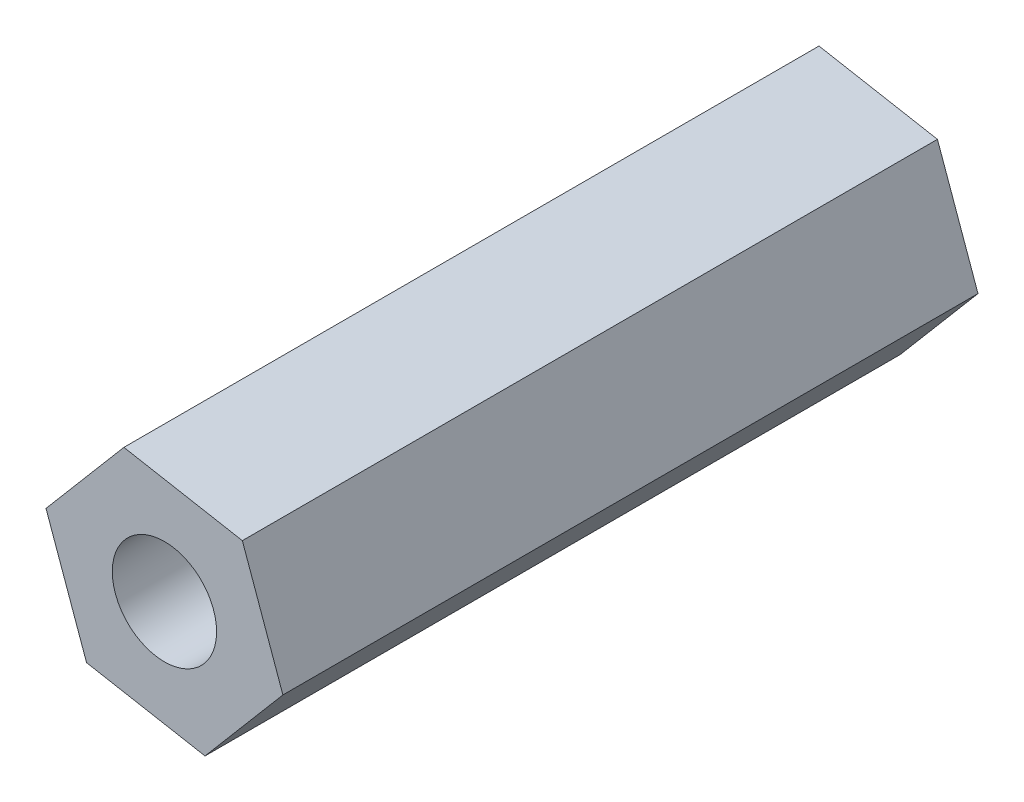
ISO-10303-21;
HEADER;
FILE_DESCRIPTION(('STEP AP214'),'2;1');
FILE_NAME('part.step','',(''),(''),'','','');
FILE_SCHEMA(('AUTOMOTIVE_DESIGN { 1 0 10303 214 1 1 1 1 }'));
ENDSEC;
DATA;
#1=APPLICATION_CONTEXT('core data for automotive mechanical design processes');
#2=APPLICATION_PROTOCOL_DEFINITION('international standard','automotive_design',2000,#1);
#3=PRODUCT_CONTEXT('',#1,'mechanical');
#4=PRODUCT('Part','Part','',(#3));
#5=PRODUCT_RELATED_PRODUCT_CATEGORY('part','',(#4));
#6=PRODUCT_DEFINITION_FORMATION('','',#4);
#7=PRODUCT_DEFINITION_CONTEXT('part definition',#1,'design');
#8=PRODUCT_DEFINITION('design','',#6,#7);
#9=PRODUCT_DEFINITION_SHAPE('','',#8);
#10=(LENGTH_UNIT() NAMED_UNIT(*) SI_UNIT(.MILLI.,.METRE.));
#11=(NAMED_UNIT(*) PLANE_ANGLE_UNIT() SI_UNIT($,.RADIAN.));
#12=(NAMED_UNIT(*) SI_UNIT($,.STERADIAN.) SOLID_ANGLE_UNIT());
#13=UNCERTAINTY_MEASURE_WITH_UNIT(LENGTH_MEASURE(1.E-05),#10,'distance_accuracy_value','');
#14=(GEOMETRIC_REPRESENTATION_CONTEXT(3) GLOBAL_UNCERTAINTY_ASSIGNED_CONTEXT((#13)) GLOBAL_UNIT_ASSIGNED_CONTEXT((#10,
#11,#12)) REPRESENTATION_CONTEXT('',''));
#15=CARTESIAN_POINT('',(0.,0.,0.));
#16=DIRECTION('',(0.,0.,1.));
#17=DIRECTION('',(1.,0.,0.));
#18=AXIS2_PLACEMENT_3D('',#15,#16,#17);
#19=CARTESIAN_POINT('',(14.100105118259,-7.40552271774973,20.));
#20=DIRECTION('',(-0.941553473498977,-0.336863557753005,0.));
#21=DIRECTION('',(0.336863557753005,-0.941553473498977,0.));
#22=AXIS2_PLACEMENT_3D('',#19,#20,#21);
#23=PLANE('',#22);
#24=DIRECTION('',(-0.336863557753005,0.941553473498977,0.));
#25=VECTOR('',#24,1.);
#26=CARTESIAN_POINT('',(14.100105118259,-7.40552271774973,0.));
#27=LINE('',#26,#25);
#28=CARTESIAN_POINT('',(14.100105118259,-7.40552271774973,0.));
#29=VERTEX_POINT('',#28);
#30=CARTESIAN_POINT('',(12.9331755237658,-4.14388580946336,0.));
#31=VERTEX_POINT('',#30);
#32=EDGE_CURVE('E117',#29,#31,#27,.T.);
#33=ORIENTED_EDGE('',*,*,#32,.T.);
#34=DIRECTION('',(0.,0.,-1.));
#35=VECTOR('',#34,1.);
#36=CARTESIAN_POINT('',(12.9331755237658,-4.14388580946336,20.));
#37=LINE('',#36,#35);
#38=CARTESIAN_POINT('',(12.9331755237658,-4.14388580946336,20.));
#39=VERTEX_POINT('',#38);
#40=EDGE_CURVE('E11',#39,#31,#37,.T.);
#41=ORIENTED_EDGE('',*,*,#40,.F.);
#42=DIRECTION('',(-0.336863557753005,0.941553473498977,0.));
#43=VECTOR('',#42,1.);
#44=CARTESIAN_POINT('',(14.100105118259,-7.40552271774973,20.));
#45=LINE('',#44,#43);
#46=CARTESIAN_POINT('',(14.100105118259,-7.40552271774973,20.));
#47=VERTEX_POINT('',#46);
#48=EDGE_CURVE('E128',#47,#39,#45,.T.);
#49=ORIENTED_EDGE('',*,*,#48,.F.);
#50=DIRECTION('',(0.,0.,-1.));
#51=VECTOR('',#50,1.);
#52=CARTESIAN_POINT('',(14.100105118259,-7.40552271774973,20.));
#53=LINE('',#52,#51);
#54=EDGE_CURVE('E113',#47,#29,#53,.T.);
#55=ORIENTED_EDGE('',*,*,#54,.T.);
#56=EDGE_LOOP('',(#33,#41,#49,#55));
#57=FACE_BOUND('',#56,.T.);
#58=ADVANCED_FACE('F33',(#57),#23,.F.);
#59=CARTESIAN_POINT('',(12.9331755237658,-4.14388580946336,20.));
#60=DIRECTION('',(-0.17904433812618,-0.983841005948094,0.));
#61=DIRECTION('',(0.983841005948094,-0.17904433812618,0.));
#62=AXIS2_PLACEMENT_3D('',#59,#60,#61);
#63=PLANE('',#62);
#64=DIRECTION('',(-0.983841005948094,0.17904433812618,0.));
#65=VECTOR('',#64,1.);
#66=CARTESIAN_POINT('',(12.9331755237658,-4.14388580946336,0.));
#67=LINE('',#66,#65);
#68=CARTESIAN_POINT('',(9.52505030602222,-3.52365802857919,0.));
#69=VERTEX_POINT('',#68);
#70=EDGE_CURVE('E120',#31,#69,#67,.T.);
#71=ORIENTED_EDGE('',*,*,#70,.T.);
#72=DIRECTION('',(0.,0.,-1.));
#73=VECTOR('',#72,1.);
#74=CARTESIAN_POINT('',(9.52505030602222,-3.52365802857919,20.));
#75=LINE('',#74,#73);
#76=CARTESIAN_POINT('',(9.52505030602222,-3.52365802857919,20.));
#77=VERTEX_POINT('',#76);
#78=EDGE_CURVE('E41',#77,#69,#75,.T.);
#79=ORIENTED_EDGE('',*,*,#78,.F.);
#80=DIRECTION('',(-0.983841005948094,0.17904433812618,0.));
#81=VECTOR('',#80,1.);
#82=CARTESIAN_POINT('',(12.9331755237658,-4.14388580946336,20.));
#83=LINE('',#82,#81);
#84=EDGE_CURVE('E86',#39,#77,#83,.T.);
#85=ORIENTED_EDGE('',*,*,#84,.F.);
#86=ORIENTED_EDGE('',*,*,#40,.T.);
#87=EDGE_LOOP('',(#71,#79,#85,#86));
#88=FACE_BOUND('',#87,.T.);
#89=ADVANCED_FACE('F153',(#88),#63,.F.);
#90=CARTESIAN_POINT('',(9.52505030602222,-3.52365802857919,20.));
#91=DIRECTION('',(0.762509135372797,-0.64697744819509,0.));
#92=DIRECTION('',(0.64697744819509,0.762509135372797,0.));
#93=AXIS2_PLACEMENT_3D('',#90,#91,#92);
#94=PLANE('',#93);
#95=DIRECTION('',(-0.64697744819509,-0.762509135372797,0.));
#96=VECTOR('',#95,1.);
#97=CARTESIAN_POINT('',(9.52505030602222,-3.52365802857919,0.));
#98=LINE('',#97,#96);
#99=CARTESIAN_POINT('',(7.28385468277191,-6.16506715598138,0.));
#100=VERTEX_POINT('',#99);
#101=EDGE_CURVE('E123',#69,#100,#98,.T.);
#102=ORIENTED_EDGE('',*,*,#101,.T.);
#103=DIRECTION('',(0.,0.,-1.));
#104=VECTOR('',#103,1.);
#105=CARTESIAN_POINT('',(7.28385468277191,-6.16506715598138,20.));
#106=LINE('',#105,#104);
#107=CARTESIAN_POINT('',(7.28385468277191,-6.16506715598138,20.));
#108=VERTEX_POINT('',#107);
#109=EDGE_CURVE('E108',#108,#100,#106,.T.);
#110=ORIENTED_EDGE('',*,*,#109,.F.);
#111=DIRECTION('',(-0.64697744819509,-0.762509135372797,0.));
#112=VECTOR('',#111,1.);
#113=CARTESIAN_POINT('',(9.52505030602222,-3.52365802857919,20.));
#114=LINE('',#113,#112);
#115=EDGE_CURVE('E99',#77,#108,#114,.T.);
#116=ORIENTED_EDGE('',*,*,#115,.F.);
#117=ORIENTED_EDGE('',*,*,#78,.T.);
#118=EDGE_LOOP('',(#102,#110,#116,#117));
#119=FACE_BOUND('',#118,.T.);
#120=ADVANCED_FACE('F134',(#119),#94,.F.);
#121=CARTESIAN_POINT('',(7.28385468277191,-6.16506715598138,20.));
#122=DIRECTION('',(0.941553473498977,0.336863557753005,0.));
#123=DIRECTION('',(-0.336863557753005,0.941553473498977,0.));
#124=AXIS2_PLACEMENT_3D('',#121,#122,#123);
#125=PLANE('',#124);
#126=DIRECTION('',(0.336863557753005,-0.941553473498977,0.));
#127=VECTOR('',#126,1.);
#128=CARTESIAN_POINT('',(7.28385468277191,-6.16506715598138,0.));
#129=LINE('',#128,#127);
#130=CARTESIAN_POINT('',(8.45078427726515,-9.42670406426776,0.));
#131=VERTEX_POINT('',#130);
#132=EDGE_CURVE('E107',#100,#131,#129,.T.);
#133=ORIENTED_EDGE('',*,*,#132,.T.);
#134=DIRECTION('',(0.,0.,-1.));
#135=VECTOR('',#134,1.);
#136=CARTESIAN_POINT('',(8.45078427726515,-9.42670406426776,20.));
#137=LINE('',#136,#135);
#138=CARTESIAN_POINT('',(8.45078427726515,-9.42670406426776,20.));
#139=VERTEX_POINT('',#138);
#140=EDGE_CURVE('E104',#139,#131,#137,.T.);
#141=ORIENTED_EDGE('',*,*,#140,.F.);
#142=DIRECTION('',(0.336863557753005,-0.941553473498977,0.));
#143=VECTOR('',#142,1.);
#144=CARTESIAN_POINT('',(7.28385468277191,-6.16506715598138,20.));
#145=LINE('',#144,#143);
#146=EDGE_CURVE('E93',#108,#139,#145,.T.);
#147=ORIENTED_EDGE('',*,*,#146,.F.);
#148=ORIENTED_EDGE('',*,*,#109,.T.);
#149=EDGE_LOOP('',(#133,#141,#147,#148));
#150=FACE_BOUND('',#149,.T.);
#151=ADVANCED_FACE('F105',(#150),#125,.F.);
#152=CARTESIAN_POINT('',(8.45078427726515,-9.42670406426776,20.));
#153=DIRECTION('',(0.17904433812618,0.983841005948094,0.));
#154=DIRECTION('',(-0.983841005948094,0.17904433812618,0.));
#155=AXIS2_PLACEMENT_3D('',#152,#153,#154);
#156=PLANE('',#155);
#157=DIRECTION('',(0.983841005948094,-0.17904433812618,0.));
#158=VECTOR('',#157,1.);
#159=CARTESIAN_POINT('',(8.45078427726515,-9.42670406426776,0.));
#160=LINE('',#159,#158);
#161=CARTESIAN_POINT('',(11.8589094950087,-10.0469318451519,0.));
#162=VERTEX_POINT('',#161);
#163=EDGE_CURVE('E72',#131,#162,#160,.T.);
#164=ORIENTED_EDGE('',*,*,#163,.T.);
#165=DIRECTION('',(0.,0.,-1.));
#166=VECTOR('',#165,1.);
#167=CARTESIAN_POINT('',(11.8589094950087,-10.0469318451519,20.));
#168=LINE('',#167,#166);
#169=CARTESIAN_POINT('',(11.8589094950087,-10.0469318451519,20.));
#170=VERTEX_POINT('',#169);
#171=EDGE_CURVE('E109',#170,#162,#168,.T.);
#172=ORIENTED_EDGE('',*,*,#171,.F.);
#173=DIRECTION('',(0.983841005948094,-0.17904433812618,0.));
#174=VECTOR('',#173,1.);
#175=CARTESIAN_POINT('',(8.45078427726515,-9.42670406426776,20.));
#176=LINE('',#175,#174);
#177=EDGE_CURVE('E97',#139,#170,#176,.T.);
#178=ORIENTED_EDGE('',*,*,#177,.F.);
#179=ORIENTED_EDGE('',*,*,#140,.T.);
#180=EDGE_LOOP('',(#164,#172,#178,#179));
#181=FACE_BOUND('',#180,.T.);
#182=ADVANCED_FACE('F111',(#181),#156,.F.);
#183=CARTESIAN_POINT('',(11.8589094950087,-10.0469318451519,20.));
#184=DIRECTION('',(-0.762509135372797,0.64697744819509,0.));
#185=DIRECTION('',(-0.64697744819509,-0.762509135372797,0.));
#186=AXIS2_PLACEMENT_3D('',#183,#184,#185);
#187=PLANE('',#186);
#188=DIRECTION('',(0.64697744819509,0.762509135372797,0.));
#189=VECTOR('',#188,1.);
#190=CARTESIAN_POINT('',(11.8589094950087,-10.0469318451519,0.));
#191=LINE('',#190,#189);
#192=EDGE_CURVE('E78',#162,#29,#191,.T.);
#193=ORIENTED_EDGE('',*,*,#192,.T.);
#194=ORIENTED_EDGE('',*,*,#54,.F.);
#195=DIRECTION('',(0.64697744819509,0.762509135372797,0.));
#196=VECTOR('',#195,1.);
#197=CARTESIAN_POINT('',(11.8589094950087,-10.0469318451519,20.));
#198=LINE('',#197,#196);
#199=EDGE_CURVE('E49',#170,#47,#198,.T.);
#200=ORIENTED_EDGE('',*,*,#199,.F.);
#201=ORIENTED_EDGE('',*,*,#171,.T.);
#202=EDGE_LOOP('',(#193,#194,#200,#201));
#203=FACE_BOUND('',#202,.T.);
#204=ADVANCED_FACE('F141',(#203),#187,.F.);
#205=CARTESIAN_POINT('',(0.,0.,20.));
#206=DIRECTION('',(0.,0.,1.));
#207=DIRECTION('',(1.,0.,0.));
#208=AXIS2_PLACEMENT_3D('',#205,#206,#207);
#209=PLANE('',#208);
#210=CARTESIAN_POINT('',(10.6919799005155,-6.78529493686556,20.));
#211=DIRECTION('',(0.,0.,1.));
#212=DIRECTION('',(1.,0.,0.));
#213=AXIS2_PLACEMENT_3D('',#210,#211,#212);
#214=CIRCLE('',#213,1.5);
#215=CARTESIAN_POINT('',(12.1919799005155,-6.78529493686556,20.));
#216=VERTEX_POINT('',#215);
#217=EDGE_CURVE('E121',#216,#216,#214,.T.);
#218=ORIENTED_EDGE('',*,*,#217,.F.);
#219=EDGE_LOOP('',(#218));
#220=FACE_BOUND('',#219,.T.);
#221=ORIENTED_EDGE('',*,*,#48,.T.);
#222=ORIENTED_EDGE('',*,*,#84,.T.);
#223=ORIENTED_EDGE('',*,*,#115,.T.);
#224=ORIENTED_EDGE('',*,*,#146,.T.);
#225=ORIENTED_EDGE('',*,*,#177,.T.);
#226=ORIENTED_EDGE('',*,*,#199,.T.);
#227=EDGE_LOOP('',(#221,#222,#223,#224,#225,#226));
#228=FACE_BOUND('',#227,.T.);
#229=ADVANCED_FACE('F95',(#220,#228),#209,.T.);
#230=CARTESIAN_POINT('',(0.,0.,0.));
#231=DIRECTION('',(0.,0.,1.));
#232=DIRECTION('',(1.,0.,0.));
#233=AXIS2_PLACEMENT_3D('',#230,#231,#232);
#234=PLANE('',#233);
#235=CARTESIAN_POINT('',(10.6919799005155,-6.78529493686556,0.));
#236=DIRECTION('',(0.,0.,-1.));
#237=DIRECTION('',(-1.,0.,0.));
#238=AXIS2_PLACEMENT_3D('',#235,#236,#237);
#239=CIRCLE('',#238,1.5);
#240=CARTESIAN_POINT('',(9.19197990051546,-6.78529493686556,0.));
#241=VERTEX_POINT('',#240);
#242=EDGE_CURVE('E208',#241,#241,#239,.T.);
#243=ORIENTED_EDGE('',*,*,#242,.F.);
#244=EDGE_LOOP('',(#243));
#245=FACE_BOUND('',#244,.T.);
#246=ORIENTED_EDGE('',*,*,#32,.F.);
#247=ORIENTED_EDGE('',*,*,#192,.F.);
#248=ORIENTED_EDGE('',*,*,#163,.F.);
#249=ORIENTED_EDGE('',*,*,#132,.F.);
#250=ORIENTED_EDGE('',*,*,#101,.F.);
#251=ORIENTED_EDGE('',*,*,#70,.F.);
#252=EDGE_LOOP('',(#246,#247,#248,#249,#250,#251));
#253=FACE_BOUND('',#252,.T.);
#254=ADVANCED_FACE('F137',(#245,#253),#234,.F.);
#255=CARTESIAN_POINT('',(10.6919799005155,-6.78529493686556,40.));
#256=DIRECTION('',(0.,0.,-1.));
#257=DIRECTION('',(-1.,0.,0.));
#258=AXIS2_PLACEMENT_3D('',#255,#256,#257);
#259=CYLINDRICAL_SURFACE('',#258,1.5);
#260=ORIENTED_EDGE('',*,*,#217,.T.);
#261=EDGE_LOOP('',(#260));
#262=FACE_BOUND('',#261,.T.);
#263=ORIENTED_EDGE('',*,*,#242,.T.);
#264=EDGE_LOOP('',(#263));
#265=FACE_BOUND('',#264,.T.);
#266=ADVANCED_FACE('F190',(#262,#265),#259,.F.);
#267=CLOSED_SHELL('',(#58,#89,#120,#151,#182,#204,#229,#254,#266));
#268=MANIFOLD_SOLID_BREP('B2',#267);
#269=ADVANCED_BREP_SHAPE_REPRESENTATION('',(#18,#268),#14);
#270=SHAPE_DEFINITION_REPRESENTATION(#9,#269);
ENDSEC;
END-ISO-10303-21;
